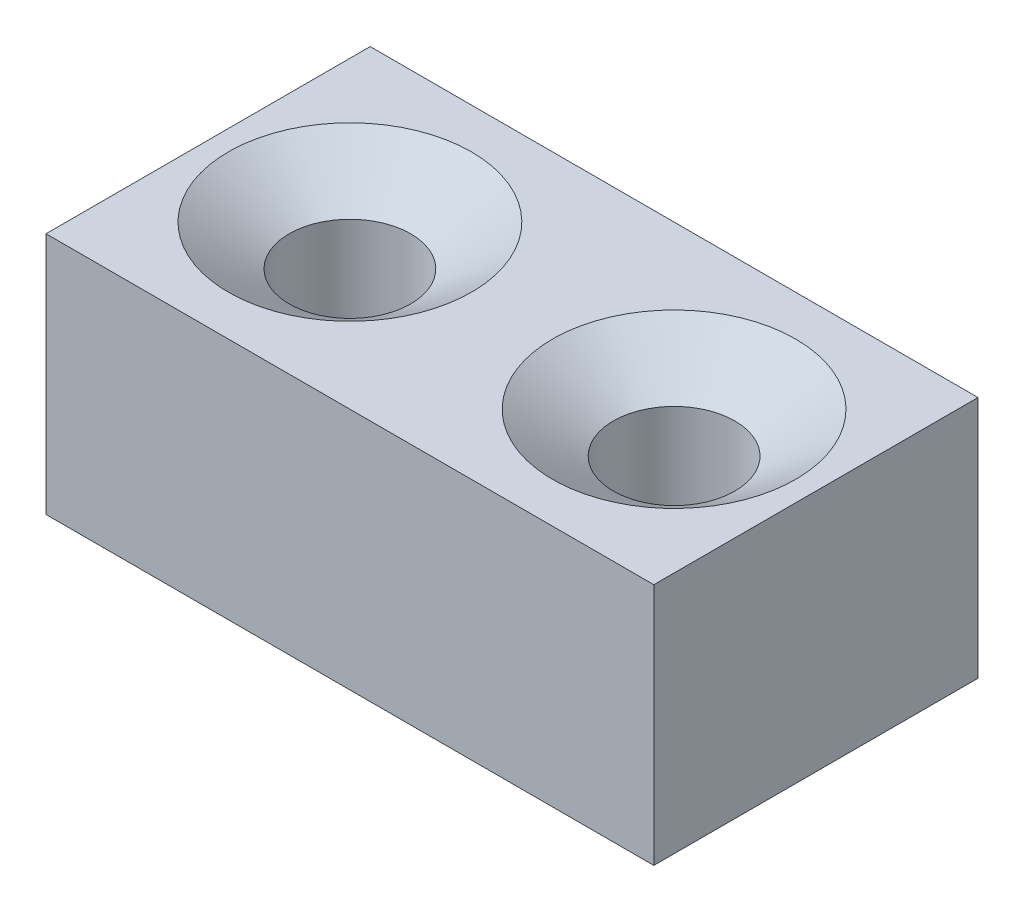
ISO-10303-21;
HEADER;
FILE_DESCRIPTION(('STEP AP214'),'2;1');
FILE_NAME('part.step','',(''),(''),'','','');
FILE_SCHEMA(('AUTOMOTIVE_DESIGN { 1 0 10303 214 1 1 1 1 }'));
ENDSEC;
DATA;
#1=APPLICATION_CONTEXT('core data for automotive mechanical design processes');
#2=APPLICATION_PROTOCOL_DEFINITION('international standard','automotive_design',2000,#1);
#3=PRODUCT_CONTEXT('',#1,'mechanical');
#4=PRODUCT('Part','Part','',(#3));
#5=PRODUCT_RELATED_PRODUCT_CATEGORY('part','',(#4));
#6=PRODUCT_DEFINITION_FORMATION('','',#4);
#7=PRODUCT_DEFINITION_CONTEXT('part definition',#1,'design');
#8=PRODUCT_DEFINITION('design','',#6,#7);
#9=PRODUCT_DEFINITION_SHAPE('','',#8);
#10=(LENGTH_UNIT() NAMED_UNIT(*) SI_UNIT(.MILLI.,.METRE.));
#11=(NAMED_UNIT(*) PLANE_ANGLE_UNIT() SI_UNIT($,.RADIAN.));
#12=(NAMED_UNIT(*) SI_UNIT($,.STERADIAN.) SOLID_ANGLE_UNIT());
#13=UNCERTAINTY_MEASURE_WITH_UNIT(LENGTH_MEASURE(1.E-05),#10,'distance_accuracy_value','');
#14=(GEOMETRIC_REPRESENTATION_CONTEXT(3) GLOBAL_UNCERTAINTY_ASSIGNED_CONTEXT((#13)) GLOBAL_UNIT_ASSIGNED_CONTEXT((#10,
#11,#12)) REPRESENTATION_CONTEXT('',''));
#15=CARTESIAN_POINT('',(0.,0.,0.));
#16=DIRECTION('',(0.,0.,1.));
#17=DIRECTION('',(1.,0.,0.));
#18=AXIS2_PLACEMENT_3D('',#15,#16,#17);
#19=CARTESIAN_POINT('',(75.,60.,40.));
#20=DIRECTION('',(-1.,0.,0.));
#21=DIRECTION('',(0.,0.,1.));
#22=AXIS2_PLACEMENT_3D('',#19,#20,#21);
#23=PLANE('',#22);
#24=DIRECTION('',(0.,0.,-1.));
#25=VECTOR('',#24,1.);
#26=CARTESIAN_POINT('',(75.,0.,40.));
#27=LINE('',#26,#25);
#28=CARTESIAN_POINT('',(75.,0.,40.));
#29=VERTEX_POINT('',#28);
#30=CARTESIAN_POINT('',(75.,0.,-40.));
#31=VERTEX_POINT('',#30);
#32=EDGE_CURVE('E96',#29,#31,#27,.T.);
#33=ORIENTED_EDGE('',*,*,#32,.T.);
#34=DIRECTION('',(0.,-1.,0.));
#35=VECTOR('',#34,1.);
#36=CARTESIAN_POINT('',(75.,60.,-40.));
#37=LINE('',#36,#35);
#38=CARTESIAN_POINT('',(75.,60.,-40.));
#39=VERTEX_POINT('',#38);
#40=EDGE_CURVE('E11',#39,#31,#37,.T.);
#41=ORIENTED_EDGE('',*,*,#40,.F.);
#42=DIRECTION('',(0.,0.,-1.));
#43=VECTOR('',#42,1.);
#44=CARTESIAN_POINT('',(75.,60.,40.));
#45=LINE('',#44,#43);
#46=CARTESIAN_POINT('',(75.,60.,40.));
#47=VERTEX_POINT('',#46);
#48=EDGE_CURVE('E84',#47,#39,#45,.T.);
#49=ORIENTED_EDGE('',*,*,#48,.F.);
#50=DIRECTION('',(0.,-1.,0.));
#51=VECTOR('',#50,1.);
#52=CARTESIAN_POINT('',(75.,60.,40.));
#53=LINE('',#52,#51);
#54=EDGE_CURVE('E92',#47,#29,#53,.T.);
#55=ORIENTED_EDGE('',*,*,#54,.T.);
#56=EDGE_LOOP('',(#33,#41,#49,#55));
#57=FACE_BOUND('',#56,.T.);
#58=ADVANCED_FACE('F33',(#57),#23,.F.);
#59=CARTESIAN_POINT('',(-75.,60.,-40.));
#60=DIRECTION('',(0.,0.,1.));
#61=DIRECTION('',(1.,0.,0.));
#62=AXIS2_PLACEMENT_3D('',#59,#60,#61);
#63=PLANE('',#62);
#64=DIRECTION('',(-1.,0.,0.));
#65=VECTOR('',#64,1.);
#66=CARTESIAN_POINT('',(-75.,0.,-40.));
#67=LINE('',#66,#65);
#68=CARTESIAN_POINT('',(-75.,0.,-40.));
#69=VERTEX_POINT('',#68);
#70=EDGE_CURVE('E88',#31,#69,#67,.T.);
#71=ORIENTED_EDGE('',*,*,#70,.T.);
#72=DIRECTION('',(0.,-1.,0.));
#73=VECTOR('',#72,1.);
#74=CARTESIAN_POINT('',(-75.,60.,-40.));
#75=LINE('',#74,#73);
#76=CARTESIAN_POINT('',(-75.,60.,-40.));
#77=VERTEX_POINT('',#76);
#78=EDGE_CURVE('E41',#77,#69,#75,.T.);
#79=ORIENTED_EDGE('',*,*,#78,.F.);
#80=DIRECTION('',(-1.,0.,0.));
#81=VECTOR('',#80,1.);
#82=CARTESIAN_POINT('',(-75.,60.,-40.));
#83=LINE('',#82,#81);
#84=EDGE_CURVE('E79',#39,#77,#83,.T.);
#85=ORIENTED_EDGE('',*,*,#84,.F.);
#86=ORIENTED_EDGE('',*,*,#40,.T.);
#87=EDGE_LOOP('',(#71,#79,#85,#86));
#88=FACE_BOUND('',#87,.T.);
#89=ADVANCED_FACE('F87',(#88),#63,.F.);
#90=CARTESIAN_POINT('',(-75.,60.,40.));
#91=DIRECTION('',(1.,0.,0.));
#92=DIRECTION('',(0.,0.,-1.));
#93=AXIS2_PLACEMENT_3D('',#90,#91,#92);
#94=PLANE('',#93);
#95=DIRECTION('',(0.,0.,1.));
#96=VECTOR('',#95,1.);
#97=CARTESIAN_POINT('',(-75.,0.,40.));
#98=LINE('',#97,#96);
#99=CARTESIAN_POINT('',(-75.,0.,40.));
#100=VERTEX_POINT('',#99);
#101=EDGE_CURVE('E66',#69,#100,#98,.T.);
#102=ORIENTED_EDGE('',*,*,#101,.T.);
#103=DIRECTION('',(0.,-1.,0.));
#104=VECTOR('',#103,1.);
#105=CARTESIAN_POINT('',(-75.,60.,40.));
#106=LINE('',#105,#104);
#107=CARTESIAN_POINT('',(-75.,60.,40.));
#108=VERTEX_POINT('',#107);
#109=EDGE_CURVE('E89',#108,#100,#106,.T.);
#110=ORIENTED_EDGE('',*,*,#109,.F.);
#111=DIRECTION('',(0.,0.,1.));
#112=VECTOR('',#111,1.);
#113=CARTESIAN_POINT('',(-75.,60.,40.));
#114=LINE('',#113,#112);
#115=EDGE_CURVE('E82',#77,#108,#114,.T.);
#116=ORIENTED_EDGE('',*,*,#115,.F.);
#117=ORIENTED_EDGE('',*,*,#78,.T.);
#118=EDGE_LOOP('',(#102,#110,#116,#117));
#119=FACE_BOUND('',#118,.T.);
#120=ADVANCED_FACE('F90',(#119),#94,.F.);
#121=CARTESIAN_POINT('',(-75.,60.,40.));
#122=DIRECTION('',(0.,0.,-1.));
#123=DIRECTION('',(-1.,0.,0.));
#124=AXIS2_PLACEMENT_3D('',#121,#122,#123);
#125=PLANE('',#124);
#126=DIRECTION('',(1.,0.,0.));
#127=VECTOR('',#126,1.);
#128=CARTESIAN_POINT('',(-75.,0.,40.));
#129=LINE('',#128,#127);
#130=EDGE_CURVE('E72',#100,#29,#129,.T.);
#131=ORIENTED_EDGE('',*,*,#130,.T.);
#132=ORIENTED_EDGE('',*,*,#54,.F.);
#133=DIRECTION('',(1.,0.,0.));
#134=VECTOR('',#133,1.);
#135=CARTESIAN_POINT('',(-75.,60.,40.));
#136=LINE('',#135,#134);
#137=EDGE_CURVE('E49',#108,#47,#136,.T.);
#138=ORIENTED_EDGE('',*,*,#137,.F.);
#139=ORIENTED_EDGE('',*,*,#109,.T.);
#140=EDGE_LOOP('',(#131,#132,#138,#139));
#141=FACE_BOUND('',#140,.T.);
#142=ADVANCED_FACE('F104',(#141),#125,.F.);
#143=CARTESIAN_POINT('',(0.,60.,0.));
#144=DIRECTION('',(0.,-1.,0.));
#145=DIRECTION('',(0.,0.,-1.));
#146=AXIS2_PLACEMENT_3D('',#143,#144,#145);
#147=PLANE('',#146);
#148=CARTESIAN_POINT('',(40.,60.,0.));
#149=DIRECTION('',(0.,1.,0.));
#150=DIRECTION('',(0.,0.,-1.));
#151=AXIS2_PLACEMENT_3D('',#148,#149,#150);
#152=CIRCLE('',#151,30.);
#153=CARTESIAN_POINT('',(40.,60.,-30.));
#154=VERTEX_POINT('',#153);
#155=EDGE_CURVE('E118',#154,#154,#152,.T.);
#156=ORIENTED_EDGE('',*,*,#155,.F.);
#157=EDGE_LOOP('',(#156));
#158=FACE_BOUND('',#157,.T.);
#159=CARTESIAN_POINT('',(-40.,60.,0.));
#160=DIRECTION('',(0.,-1.,0.));
#161=DIRECTION('',(0.,0.,-1.));
#162=AXIS2_PLACEMENT_3D('',#159,#160,#161);
#163=CIRCLE('',#162,30.);
#164=CARTESIAN_POINT('',(-40.,60.,-30.));
#165=VERTEX_POINT('',#164);
#166=EDGE_CURVE('E99',#165,#165,#163,.T.);
#167=ORIENTED_EDGE('',*,*,#166,.T.);
#168=EDGE_LOOP('',(#167));
#169=FACE_BOUND('',#168,.T.);
#170=ORIENTED_EDGE('',*,*,#48,.T.);
#171=ORIENTED_EDGE('',*,*,#84,.T.);
#172=ORIENTED_EDGE('',*,*,#115,.T.);
#173=ORIENTED_EDGE('',*,*,#137,.T.);
#174=EDGE_LOOP('',(#170,#171,#172,#173));
#175=FACE_BOUND('',#174,.T.);
#176=ADVANCED_FACE('F80',(#158,#169,#175),#147,.F.);
#177=CARTESIAN_POINT('',(0.,0.,0.));
#178=DIRECTION('',(0.,-1.,0.));
#179=DIRECTION('',(0.,0.,-1.));
#180=AXIS2_PLACEMENT_3D('',#177,#178,#179);
#181=PLANE('',#180);
#182=ORIENTED_EDGE('',*,*,#32,.F.);
#183=ORIENTED_EDGE('',*,*,#130,.F.);
#184=ORIENTED_EDGE('',*,*,#101,.F.);
#185=ORIENTED_EDGE('',*,*,#70,.F.);
#186=EDGE_LOOP('',(#182,#183,#184,#185));
#187=FACE_BOUND('',#186,.T.);
#188=ADVANCED_FACE('F107',(#187),#181,.T.);
#189=CARTESIAN_POINT('',(-40.,60.,0.));
#190=DIRECTION('',(0.,1.,0.));
#191=DIRECTION('',(0.,0.,1.));
#192=AXIS2_PLACEMENT_3D('',#189,#190,#191);
#193=CONICAL_SURFACE('',#192,30.,0.98279372324733);
#194=CARTESIAN_POINT('',(-40.,50.,0.));
#195=DIRECTION('',(0.,-1.,0.));
#196=DIRECTION('',(0.,0.,-1.));
#197=AXIS2_PLACEMENT_3D('',#194,#195,#196);
#198=CIRCLE('',#197,15.);
#199=CARTESIAN_POINT('',(-40.,50.,-15.));
#200=VERTEX_POINT('',#199);
#201=EDGE_CURVE('E112',#200,#200,#198,.T.);
#202=ORIENTED_EDGE('',*,*,#201,.T.);
#203=EDGE_LOOP('',(#202));
#204=FACE_BOUND('',#203,.T.);
#205=ORIENTED_EDGE('',*,*,#166,.F.);
#206=EDGE_LOOP('',(#205));
#207=FACE_BOUND('',#206,.T.);
#208=ADVANCED_FACE('F148',(#204,#207),#193,.F.);
#209=CARTESIAN_POINT('',(-40.,9.99999999999999,0.));
#210=DIRECTION('',(0.,-1.,0.));
#211=DIRECTION('',(0.,0.,-1.));
#212=AXIS2_PLACEMENT_3D('',#209,#210,#211);
#213=CYLINDRICAL_SURFACE('',#212,15.);
#214=CARTESIAN_POINT('',(-40.,9.99999999999999,0.));
#215=DIRECTION('',(0.,-1.,0.));
#216=DIRECTION('',(0.,0.,-1.));
#217=AXIS2_PLACEMENT_3D('',#214,#215,#216);
#218=CIRCLE('',#217,15.);
#219=CARTESIAN_POINT('',(-40.,9.99999999999999,-15.));
#220=VERTEX_POINT('',#219);
#221=EDGE_CURVE('E115',#220,#220,#218,.T.);
#222=ORIENTED_EDGE('',*,*,#221,.T.);
#223=EDGE_LOOP('',(#222));
#224=FACE_BOUND('',#223,.T.);
#225=ORIENTED_EDGE('',*,*,#201,.F.);
#226=EDGE_LOOP('',(#225));
#227=FACE_BOUND('',#226,.T.);
#228=ADVANCED_FACE('F150',(#224,#227),#213,.F.);
#229=CARTESIAN_POINT('',(-55.,9.99999999999999,0.));
#230=DIRECTION('',(0.,1.,0.));
#231=DIRECTION('',(0.,0.,1.));
#232=AXIS2_PLACEMENT_3D('',#229,#230,#231);
#233=PLANE('',#232);
#234=ORIENTED_EDGE('',*,*,#221,.F.);
#235=EDGE_LOOP('',(#234));
#236=FACE_BOUND('',#235,.T.);
#237=ADVANCED_FACE('F139',(#236),#233,.T.);
#238=CARTESIAN_POINT('',(40.,60.,0.));
#239=DIRECTION('',(0.,1.,0.));
#240=DIRECTION('',(0.,0.,1.));
#241=AXIS2_PLACEMENT_3D('',#238,#239,#240);
#242=CONICAL_SURFACE('',#241,30.,0.98279372324733);
#243=CARTESIAN_POINT('',(40.,50.,0.));
#244=DIRECTION('',(0.,1.,0.));
#245=DIRECTION('',(0.,0.,-1.));
#246=AXIS2_PLACEMENT_3D('',#243,#244,#245);
#247=CIRCLE('',#246,15.);
#248=CARTESIAN_POINT('',(40.,50.,-15.));
#249=VERTEX_POINT('',#248);
#250=EDGE_CURVE('E121',#249,#249,#247,.T.);
#251=ORIENTED_EDGE('',*,*,#250,.F.);
#252=EDGE_LOOP('',(#251));
#253=FACE_BOUND('',#252,.T.);
#254=ORIENTED_EDGE('',*,*,#155,.T.);
#255=EDGE_LOOP('',(#254));
#256=FACE_BOUND('',#255,.T.);
#257=ADVANCED_FACE('F133',(#253,#256),#242,.F.);
#258=CARTESIAN_POINT('',(40.,9.99999999999999,0.));
#259=DIRECTION('',(0.,-1.,0.));
#260=DIRECTION('',(0.,0.,-1.));
#261=AXIS2_PLACEMENT_3D('',#258,#259,#260);
#262=CYLINDRICAL_SURFACE('',#261,15.);
#263=CARTESIAN_POINT('',(40.,9.99999999999999,0.));
#264=DIRECTION('',(0.,1.,0.));
#265=DIRECTION('',(0.,0.,-1.));
#266=AXIS2_PLACEMENT_3D('',#263,#264,#265);
#267=CIRCLE('',#266,15.);
#268=CARTESIAN_POINT('',(40.,9.99999999999999,-15.));
#269=VERTEX_POINT('',#268);
#270=EDGE_CURVE('E124',#269,#269,#267,.T.);
#271=ORIENTED_EDGE('',*,*,#270,.F.);
#272=EDGE_LOOP('',(#271));
#273=FACE_BOUND('',#272,.T.);
#274=ORIENTED_EDGE('',*,*,#250,.T.);
#275=EDGE_LOOP('',(#274));
#276=FACE_BOUND('',#275,.T.);
#277=ADVANCED_FACE('F130',(#273,#276),#262,.F.);
#278=CARTESIAN_POINT('',(55.,9.99999999999999,0.));
#279=DIRECTION('',(0.,1.,0.));
#280=DIRECTION('',(0.,0.,1.));
#281=AXIS2_PLACEMENT_3D('',#278,#279,#280);
#282=PLANE('',#281);
#283=ORIENTED_EDGE('',*,*,#270,.T.);
#284=EDGE_LOOP('',(#283));
#285=FACE_BOUND('',#284,.T.);
#286=ADVANCED_FACE('F128',(#285),#282,.T.);
#287=CLOSED_SHELL('',(#58,#89,#120,#142,#176,#188,#208,#228,#237,#257,#277,#286));
#288=MANIFOLD_SOLID_BREP('B2',#287);
#289=ADVANCED_BREP_SHAPE_REPRESENTATION('',(#18,#288),#14);
#290=SHAPE_DEFINITION_REPRESENTATION(#9,#289);
ENDSEC;
END-ISO-10303-21;
